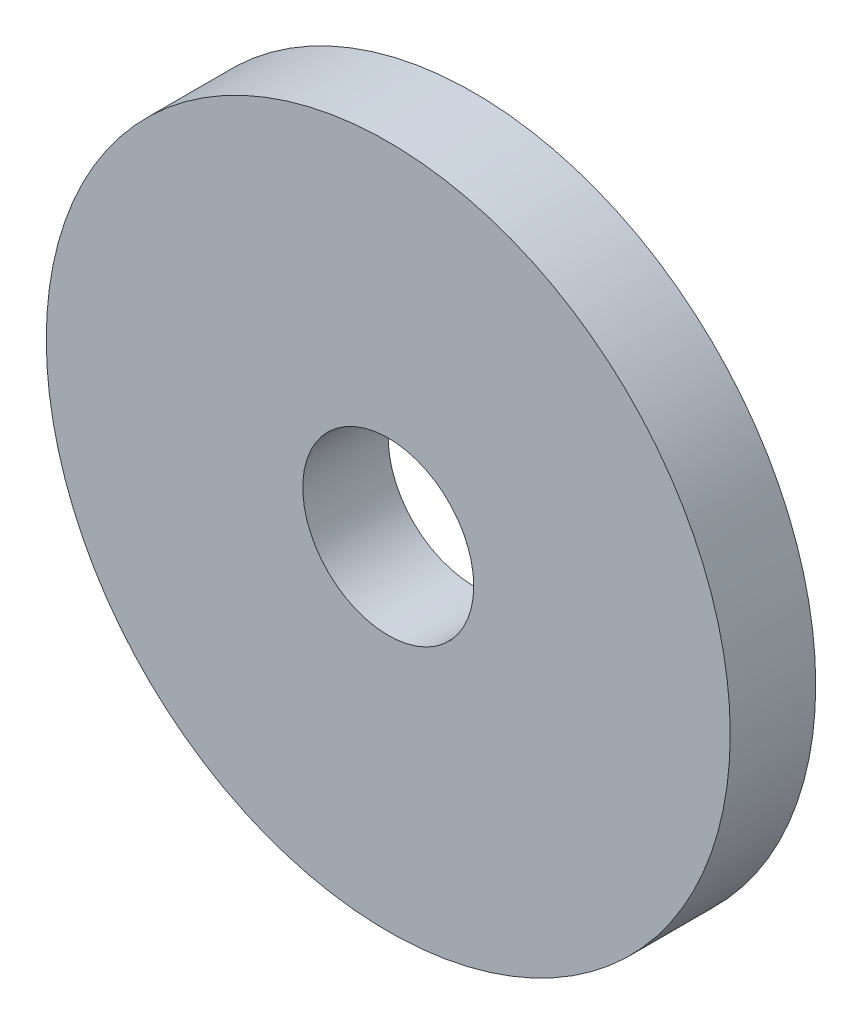
ISO-10303-21;
HEADER;
FILE_DESCRIPTION(('STEP AP214'),'2;1');
FILE_NAME('part.step','',(''),(''),'','','');
FILE_SCHEMA(('AUTOMOTIVE_DESIGN { 1 0 10303 214 1 1 1 1 }'));
ENDSEC;
DATA;
#1=APPLICATION_CONTEXT('core data for automotive mechanical design processes');
#2=APPLICATION_PROTOCOL_DEFINITION('international standard','automotive_design',2000,#1);
#3=PRODUCT_CONTEXT('',#1,'mechanical');
#4=PRODUCT('Part','Part','',(#3));
#5=PRODUCT_RELATED_PRODUCT_CATEGORY('part','',(#4));
#6=PRODUCT_DEFINITION_FORMATION('','',#4);
#7=PRODUCT_DEFINITION_CONTEXT('part definition',#1,'design');
#8=PRODUCT_DEFINITION('design','',#6,#7);
#9=PRODUCT_DEFINITION_SHAPE('','',#8);
#10=(LENGTH_UNIT() NAMED_UNIT(*) SI_UNIT(.MILLI.,.METRE.));
#11=(NAMED_UNIT(*) PLANE_ANGLE_UNIT() SI_UNIT($,.RADIAN.));
#12=(NAMED_UNIT(*) SI_UNIT($,.STERADIAN.) SOLID_ANGLE_UNIT());
#13=UNCERTAINTY_MEASURE_WITH_UNIT(LENGTH_MEASURE(1.E-05),#10,'distance_accuracy_value','');
#14=(GEOMETRIC_REPRESENTATION_CONTEXT(3) GLOBAL_UNCERTAINTY_ASSIGNED_CONTEXT((#13)) GLOBAL_UNIT_ASSIGNED_CONTEXT((#10,
#11,#12)) REPRESENTATION_CONTEXT('',''));
#15=CARTESIAN_POINT('',(0.,0.,0.));
#16=DIRECTION('',(0.,0.,1.));
#17=DIRECTION('',(1.,0.,0.));
#18=AXIS2_PLACEMENT_3D('',#15,#16,#17);
#19=CARTESIAN_POINT('',(0.,0.,-10.));
#20=DIRECTION('',(0.,0.,1.));
#21=DIRECTION('',(1.,0.,0.));
#22=AXIS2_PLACEMENT_3D('',#19,#20,#21);
#23=CYLINDRICAL_SURFACE('',#22,40.);
#24=CARTESIAN_POINT('',(0.,0.,-10.));
#25=DIRECTION('',(0.,0.,1.));
#26=DIRECTION('',(1.,0.,0.));
#27=AXIS2_PLACEMENT_3D('',#24,#25,#26);
#28=CIRCLE('',#27,40.);
#29=CARTESIAN_POINT('',(40.,0.,-10.));
#30=VERTEX_POINT('',#29);
#31=EDGE_CURVE('E10',#30,#30,#28,.T.);
#32=ORIENTED_EDGE('',*,*,#31,.T.);
#33=EDGE_LOOP('',(#32));
#34=FACE_BOUND('',#33,.T.);
#35=CARTESIAN_POINT('',(0.,0.,0.));
#36=DIRECTION('',(0.,0.,1.));
#37=DIRECTION('',(1.,0.,0.));
#38=AXIS2_PLACEMENT_3D('',#35,#36,#37);
#39=CIRCLE('',#38,40.);
#40=CARTESIAN_POINT('',(40.,0.,0.));
#41=VERTEX_POINT('',#40);
#42=EDGE_CURVE('E39',#41,#41,#39,.T.);
#43=ORIENTED_EDGE('',*,*,#42,.F.);
#44=EDGE_LOOP('',(#43));
#45=FACE_BOUND('',#44,.T.);
#46=ADVANCED_FACE('F36',(#34,#45),#23,.T.);
#47=CARTESIAN_POINT('',(0.,0.,-10.));
#48=DIRECTION('',(0.,0.,1.));
#49=DIRECTION('',(1.,0.,0.));
#50=AXIS2_PLACEMENT_3D('',#47,#48,#49);
#51=PLANE('',#50);
#52=CARTESIAN_POINT('',(0.,0.,-10.));
#53=DIRECTION('',(0.,0.,1.));
#54=DIRECTION('',(1.,0.,0.));
#55=AXIS2_PLACEMENT_3D('',#52,#53,#54);
#56=CIRCLE('',#55,10.);
#57=CARTESIAN_POINT('',(10.,0.,-10.));
#58=VERTEX_POINT('',#57);
#59=EDGE_CURVE('E48',#58,#58,#56,.T.);
#60=ORIENTED_EDGE('',*,*,#59,.T.);
#61=EDGE_LOOP('',(#60));
#62=FACE_BOUND('',#61,.T.);
#63=ORIENTED_EDGE('',*,*,#31,.F.);
#64=EDGE_LOOP('',(#63));
#65=FACE_BOUND('',#64,.T.);
#66=ADVANCED_FACE('F58',(#62,#65),#51,.F.);
#67=CARTESIAN_POINT('',(0.,0.,0.));
#68=DIRECTION('',(0.,0.,1.));
#69=DIRECTION('',(1.,0.,0.));
#70=AXIS2_PLACEMENT_3D('',#67,#68,#69);
#71=PLANE('',#70);
#72=CARTESIAN_POINT('',(0.,0.,0.));
#73=DIRECTION('',(0.,0.,1.));
#74=DIRECTION('',(1.,0.,0.));
#75=AXIS2_PLACEMENT_3D('',#72,#73,#74);
#76=CIRCLE('',#75,10.);
#77=CARTESIAN_POINT('',(10.,0.,0.));
#78=VERTEX_POINT('',#77);
#79=EDGE_CURVE('E50',#78,#78,#76,.T.);
#80=ORIENTED_EDGE('',*,*,#79,.F.);
#81=EDGE_LOOP('',(#80));
#82=FACE_BOUND('',#81,.T.);
#83=ORIENTED_EDGE('',*,*,#42,.T.);
#84=EDGE_LOOP('',(#83));
#85=FACE_BOUND('',#84,.T.);
#86=ADVANCED_FACE('F64',(#82,#85),#71,.T.);
#87=CARTESIAN_POINT('',(0.,0.,-10.));
#88=DIRECTION('',(0.,0.,1.));
#89=DIRECTION('',(1.,0.,0.));
#90=AXIS2_PLACEMENT_3D('',#87,#88,#89);
#91=CYLINDRICAL_SURFACE('',#90,10.);
#92=ORIENTED_EDGE('',*,*,#59,.F.);
#93=EDGE_LOOP('',(#92));
#94=FACE_BOUND('',#93,.T.);
#95=ORIENTED_EDGE('',*,*,#79,.T.);
#96=EDGE_LOOP('',(#95));
#97=FACE_BOUND('',#96,.T.);
#98=ADVANCED_FACE('F61',(#94,#97),#91,.F.);
#99=CLOSED_SHELL('',(#46,#66,#86,#98));
#100=MANIFOLD_SOLID_BREP('B2',#99);
#101=ADVANCED_BREP_SHAPE_REPRESENTATION('',(#18,#100),#14);
#102=SHAPE_DEFINITION_REPRESENTATION(#9,#101);
ENDSEC;
END-ISO-10303-21;
